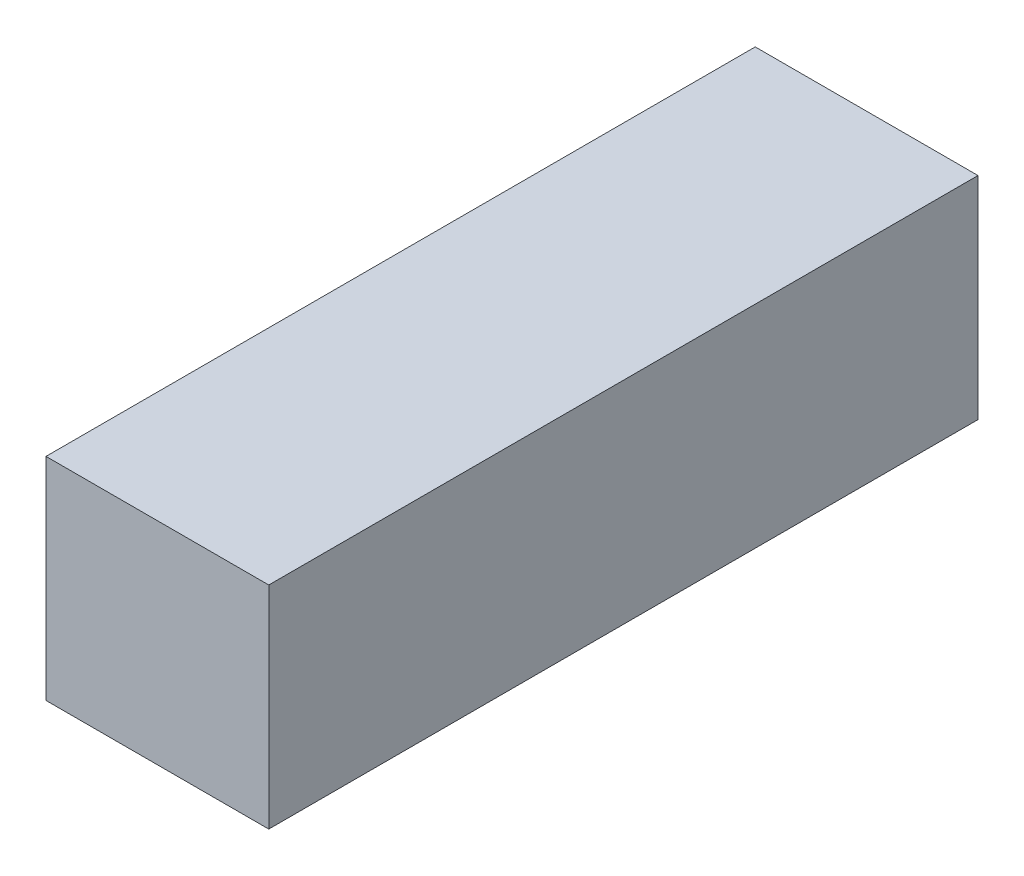
ISO-10303-21;
HEADER;
FILE_DESCRIPTION(('STEP AP214'),'2;1');
FILE_NAME('part.step','',(''),(''),'','','');
FILE_SCHEMA(('AUTOMOTIVE_DESIGN { 1 0 10303 214 1 1 1 1 }'));
ENDSEC;
DATA;
#1=APPLICATION_CONTEXT('core data for automotive mechanical design processes');
#2=APPLICATION_PROTOCOL_DEFINITION('international standard','automotive_design',2000,#1);
#3=PRODUCT_CONTEXT('',#1,'mechanical');
#4=PRODUCT('Part','Part','',(#3));
#5=PRODUCT_RELATED_PRODUCT_CATEGORY('part','',(#4));
#6=PRODUCT_DEFINITION_FORMATION('','',#4);
#7=PRODUCT_DEFINITION_CONTEXT('part definition',#1,'design');
#8=PRODUCT_DEFINITION('design','',#6,#7);
#9=PRODUCT_DEFINITION_SHAPE('','',#8);
#10=(LENGTH_UNIT() NAMED_UNIT(*) SI_UNIT(.MILLI.,.METRE.));
#11=(NAMED_UNIT(*) PLANE_ANGLE_UNIT() SI_UNIT($,.RADIAN.));
#12=(NAMED_UNIT(*) SI_UNIT($,.STERADIAN.) SOLID_ANGLE_UNIT());
#13=UNCERTAINTY_MEASURE_WITH_UNIT(LENGTH_MEASURE(1.E-05),#10,'distance_accuracy_value','');
#14=(GEOMETRIC_REPRESENTATION_CONTEXT(3) GLOBAL_UNCERTAINTY_ASSIGNED_CONTEXT((#13)) GLOBAL_UNIT_ASSIGNED_CONTEXT((#10,
#11,#12)) REPRESENTATION_CONTEXT('',''));
#15=CARTESIAN_POINT('',(0.,0.,0.));
#16=DIRECTION('',(0.,0.,1.));
#17=DIRECTION('',(1.,0.,0.));
#18=AXIS2_PLACEMENT_3D('',#15,#16,#17);
#19=CARTESIAN_POINT('',(24.5,-23.25,156.));
#20=DIRECTION('',(-1.,0.,0.));
#21=DIRECTION('',(0.,0.,1.));
#22=AXIS2_PLACEMENT_3D('',#19,#20,#21);
#23=PLANE('',#22);
#24=DIRECTION('',(0.,1.,0.));
#25=VECTOR('',#24,1.);
#26=CARTESIAN_POINT('',(24.5,-23.25,0.));
#27=LINE('',#26,#25);
#28=CARTESIAN_POINT('',(24.5,-23.25,0.));
#29=VERTEX_POINT('',#28);
#30=CARTESIAN_POINT('',(24.5,23.25,0.));
#31=VERTEX_POINT('',#30);
#32=EDGE_CURVE('E96',#29,#31,#27,.T.);
#33=ORIENTED_EDGE('',*,*,#32,.T.);
#34=DIRECTION('',(0.,0.,-1.));
#35=VECTOR('',#34,1.);
#36=CARTESIAN_POINT('',(24.5,23.25,156.));
#37=LINE('',#36,#35);
#38=CARTESIAN_POINT('',(24.5,23.25,156.));
#39=VERTEX_POINT('',#38);
#40=EDGE_CURVE('E11',#39,#31,#37,.T.);
#41=ORIENTED_EDGE('',*,*,#40,.F.);
#42=DIRECTION('',(0.,1.,0.));
#43=VECTOR('',#42,1.);
#44=CARTESIAN_POINT('',(24.5,-23.25,156.));
#45=LINE('',#44,#43);
#46=CARTESIAN_POINT('',(24.5,-23.25,156.));
#47=VERTEX_POINT('',#46);
#48=EDGE_CURVE('E84',#47,#39,#45,.T.);
#49=ORIENTED_EDGE('',*,*,#48,.F.);
#50=DIRECTION('',(0.,0.,-1.));
#51=VECTOR('',#50,1.);
#52=CARTESIAN_POINT('',(24.5,-23.25,156.));
#53=LINE('',#52,#51);
#54=EDGE_CURVE('E92',#47,#29,#53,.T.);
#55=ORIENTED_EDGE('',*,*,#54,.T.);
#56=EDGE_LOOP('',(#33,#41,#49,#55));
#57=FACE_BOUND('',#56,.T.);
#58=ADVANCED_FACE('F33',(#57),#23,.F.);
#59=CARTESIAN_POINT('',(-24.5,23.25,156.));
#60=DIRECTION('',(0.,-1.,0.));
#61=DIRECTION('',(0.,0.,-1.));
#62=AXIS2_PLACEMENT_3D('',#59,#60,#61);
#63=PLANE('',#62);
#64=DIRECTION('',(-1.,0.,0.));
#65=VECTOR('',#64,1.);
#66=CARTESIAN_POINT('',(-24.5,23.25,0.));
#67=LINE('',#66,#65);
#68=CARTESIAN_POINT('',(-24.5,23.25,0.));
#69=VERTEX_POINT('',#68);
#70=EDGE_CURVE('E88',#31,#69,#67,.T.);
#71=ORIENTED_EDGE('',*,*,#70,.T.);
#72=DIRECTION('',(0.,0.,-1.));
#73=VECTOR('',#72,1.);
#74=CARTESIAN_POINT('',(-24.5,23.25,156.));
#75=LINE('',#74,#73);
#76=CARTESIAN_POINT('',(-24.5,23.25,156.));
#77=VERTEX_POINT('',#76);
#78=EDGE_CURVE('E41',#77,#69,#75,.T.);
#79=ORIENTED_EDGE('',*,*,#78,.F.);
#80=DIRECTION('',(-1.,0.,0.));
#81=VECTOR('',#80,1.);
#82=CARTESIAN_POINT('',(-24.5,23.25,156.));
#83=LINE('',#82,#81);
#84=EDGE_CURVE('E79',#39,#77,#83,.T.);
#85=ORIENTED_EDGE('',*,*,#84,.F.);
#86=ORIENTED_EDGE('',*,*,#40,.T.);
#87=EDGE_LOOP('',(#71,#79,#85,#86));
#88=FACE_BOUND('',#87,.T.);
#89=ADVANCED_FACE('F87',(#88),#63,.F.);
#90=CARTESIAN_POINT('',(-24.5,-23.25,156.));
#91=DIRECTION('',(1.,0.,0.));
#92=DIRECTION('',(0.,0.,-1.));
#93=AXIS2_PLACEMENT_3D('',#90,#91,#92);
#94=PLANE('',#93);
#95=DIRECTION('',(0.,-1.,0.));
#96=VECTOR('',#95,1.);
#97=CARTESIAN_POINT('',(-24.5,-23.25,0.));
#98=LINE('',#97,#96);
#99=CARTESIAN_POINT('',(-24.5,-23.25,0.));
#100=VERTEX_POINT('',#99);
#101=EDGE_CURVE('E66',#69,#100,#98,.T.);
#102=ORIENTED_EDGE('',*,*,#101,.T.);
#103=DIRECTION('',(0.,0.,-1.));
#104=VECTOR('',#103,1.);
#105=CARTESIAN_POINT('',(-24.5,-23.25,156.));
#106=LINE('',#105,#104);
#107=CARTESIAN_POINT('',(-24.5,-23.25,156.));
#108=VERTEX_POINT('',#107);
#109=EDGE_CURVE('E89',#108,#100,#106,.T.);
#110=ORIENTED_EDGE('',*,*,#109,.F.);
#111=DIRECTION('',(0.,-1.,0.));
#112=VECTOR('',#111,1.);
#113=CARTESIAN_POINT('',(-24.5,-23.25,156.));
#114=LINE('',#113,#112);
#115=EDGE_CURVE('E82',#77,#108,#114,.T.);
#116=ORIENTED_EDGE('',*,*,#115,.F.);
#117=ORIENTED_EDGE('',*,*,#78,.T.);
#118=EDGE_LOOP('',(#102,#110,#116,#117));
#119=FACE_BOUND('',#118,.T.);
#120=ADVANCED_FACE('F90',(#119),#94,.F.);
#121=CARTESIAN_POINT('',(-24.5,-23.25,156.));
#122=DIRECTION('',(0.,1.,0.));
#123=DIRECTION('',(0.,0.,1.));
#124=AXIS2_PLACEMENT_3D('',#121,#122,#123);
#125=PLANE('',#124);
#126=DIRECTION('',(1.,0.,0.));
#127=VECTOR('',#126,1.);
#128=CARTESIAN_POINT('',(-24.5,-23.25,0.));
#129=LINE('',#128,#127);
#130=EDGE_CURVE('E72',#100,#29,#129,.T.);
#131=ORIENTED_EDGE('',*,*,#130,.T.);
#132=ORIENTED_EDGE('',*,*,#54,.F.);
#133=DIRECTION('',(1.,0.,0.));
#134=VECTOR('',#133,1.);
#135=CARTESIAN_POINT('',(-24.5,-23.25,156.));
#136=LINE('',#135,#134);
#137=EDGE_CURVE('E49',#108,#47,#136,.T.);
#138=ORIENTED_EDGE('',*,*,#137,.F.);
#139=ORIENTED_EDGE('',*,*,#109,.T.);
#140=EDGE_LOOP('',(#131,#132,#138,#139));
#141=FACE_BOUND('',#140,.T.);
#142=ADVANCED_FACE('F103',(#141),#125,.F.);
#143=CARTESIAN_POINT('',(0.,0.,156.));
#144=DIRECTION('',(0.,0.,-1.));
#145=DIRECTION('',(-1.,0.,0.));
#146=AXIS2_PLACEMENT_3D('',#143,#144,#145);
#147=PLANE('',#146);
#148=ORIENTED_EDGE('',*,*,#48,.T.);
#149=ORIENTED_EDGE('',*,*,#84,.T.);
#150=ORIENTED_EDGE('',*,*,#115,.T.);
#151=ORIENTED_EDGE('',*,*,#137,.T.);
#152=EDGE_LOOP('',(#148,#149,#150,#151));
#153=FACE_BOUND('',#152,.T.);
#154=ADVANCED_FACE('F80',(#153),#147,.F.);
#155=CARTESIAN_POINT('',(0.,0.,0.));
#156=DIRECTION('',(0.,0.,-1.));
#157=DIRECTION('',(-1.,0.,0.));
#158=AXIS2_PLACEMENT_3D('',#155,#156,#157);
#159=PLANE('',#158);
#160=ORIENTED_EDGE('',*,*,#32,.F.);
#161=ORIENTED_EDGE('',*,*,#130,.F.);
#162=ORIENTED_EDGE('',*,*,#101,.F.);
#163=ORIENTED_EDGE('',*,*,#70,.F.);
#164=EDGE_LOOP('',(#160,#161,#162,#163));
#165=FACE_BOUND('',#164,.T.);
#166=ADVANCED_FACE('F106',(#165),#159,.T.);
#167=CLOSED_SHELL('',(#58,#89,#120,#142,#154,#166));
#168=MANIFOLD_SOLID_BREP('B2',#167);
#169=ADVANCED_BREP_SHAPE_REPRESENTATION('',(#18,#168),#14);
#170=SHAPE_DEFINITION_REPRESENTATION(#9,#169);
ENDSEC;
END-ISO-10303-21;
